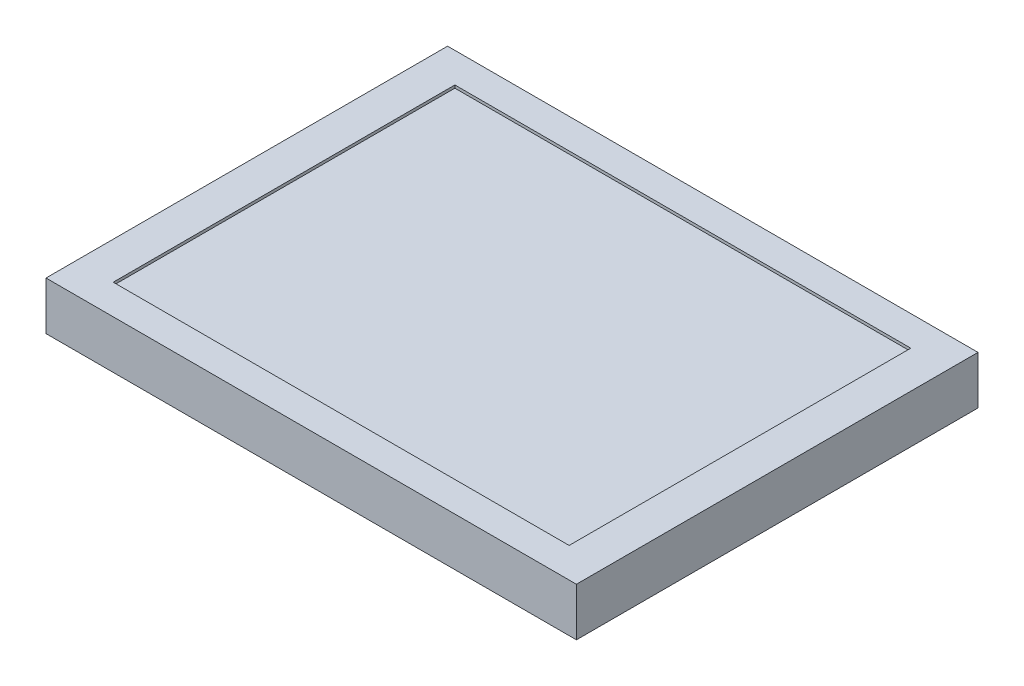
ISO-10303-21;
HEADER;
FILE_DESCRIPTION(('STEP AP214'),'2;1');
FILE_NAME('part.step','',(''),(''),'','','');
FILE_SCHEMA(('AUTOMOTIVE_DESIGN { 1 0 10303 214 1 1 1 1 }'));
ENDSEC;
DATA;
#1=APPLICATION_CONTEXT('core data for automotive mechanical design processes');
#2=APPLICATION_PROTOCOL_DEFINITION('international standard','automotive_design',2000,#1);
#3=PRODUCT_CONTEXT('',#1,'mechanical');
#4=PRODUCT('Part','Part','',(#3));
#5=PRODUCT_RELATED_PRODUCT_CATEGORY('part','',(#4));
#6=PRODUCT_DEFINITION_FORMATION('','',#4);
#7=PRODUCT_DEFINITION_CONTEXT('part definition',#1,'design');
#8=PRODUCT_DEFINITION('design','',#6,#7);
#9=PRODUCT_DEFINITION_SHAPE('','',#8);
#10=(LENGTH_UNIT() NAMED_UNIT(*) SI_UNIT(.MILLI.,.METRE.));
#11=(NAMED_UNIT(*) PLANE_ANGLE_UNIT() SI_UNIT($,.RADIAN.));
#12=(NAMED_UNIT(*) SI_UNIT($,.STERADIAN.) SOLID_ANGLE_UNIT());
#13=UNCERTAINTY_MEASURE_WITH_UNIT(LENGTH_MEASURE(1.E-05),#10,'distance_accuracy_value','');
#14=(GEOMETRIC_REPRESENTATION_CONTEXT(3) GLOBAL_UNCERTAINTY_ASSIGNED_CONTEXT((#13)) GLOBAL_UNIT_ASSIGNED_CONTEXT((#10,
#11,#12)) REPRESENTATION_CONTEXT('',''));
#15=CARTESIAN_POINT('',(0.,0.,0.));
#16=DIRECTION('',(0.,0.,1.));
#17=DIRECTION('',(1.,0.,0.));
#18=AXIS2_PLACEMENT_3D('',#15,#16,#17);
#19=CARTESIAN_POINT('',(0.,8.6,0.));
#20=DIRECTION('',(1.,0.,0.));
#21=DIRECTION('',(0.,0.,-1.));
#22=AXIS2_PLACEMENT_3D('',#19,#20,#21);
#23=PLANE('',#22);
#24=DIRECTION('',(0.,0.,1.));
#25=VECTOR('',#24,1.);
#26=CARTESIAN_POINT('',(0.,0.,0.));
#27=LINE('',#26,#25);
#28=CARTESIAN_POINT('',(0.,0.,-71.7));
#29=VERTEX_POINT('',#28);
#30=CARTESIAN_POINT('',(0.,0.,0.));
#31=VERTEX_POINT('',#30);
#32=EDGE_CURVE('E139',#29,#31,#27,.T.);
#33=ORIENTED_EDGE('',*,*,#32,.T.);
#34=DIRECTION('',(0.,-1.,0.));
#35=VECTOR('',#34,1.);
#36=CARTESIAN_POINT('',(0.,8.6,0.));
#37=LINE('',#36,#35);
#38=CARTESIAN_POINT('',(0.,8.6,0.));
#39=VERTEX_POINT('',#38);
#40=EDGE_CURVE('E11',#39,#31,#37,.T.);
#41=ORIENTED_EDGE('',*,*,#40,.F.);
#42=DIRECTION('',(0.,0.,1.));
#43=VECTOR('',#42,1.);
#44=CARTESIAN_POINT('',(0.,8.6,0.));
#45=LINE('',#44,#43);
#46=CARTESIAN_POINT('',(0.,8.6,-71.7));
#47=VERTEX_POINT('',#46);
#48=EDGE_CURVE('E143',#47,#39,#45,.T.);
#49=ORIENTED_EDGE('',*,*,#48,.F.);
#50=DIRECTION('',(0.,-1.,0.));
#51=VECTOR('',#50,1.);
#52=CARTESIAN_POINT('',(0.,8.6,-71.7));
#53=LINE('',#52,#51);
#54=EDGE_CURVE('E149',#47,#29,#53,.T.);
#55=ORIENTED_EDGE('',*,*,#54,.T.);
#56=EDGE_LOOP('',(#33,#41,#49,#55));
#57=FACE_BOUND('',#56,.T.);
#58=ADVANCED_FACE('F31',(#57),#23,.F.);
#59=CARTESIAN_POINT('',(0.,8.6,0.));
#60=DIRECTION('',(0.,0.,-1.));
#61=DIRECTION('',(-1.,0.,0.));
#62=AXIS2_PLACEMENT_3D('',#59,#60,#61);
#63=PLANE('',#62);
#64=DIRECTION('',(1.,0.,0.));
#65=VECTOR('',#64,1.);
#66=CARTESIAN_POINT('',(0.,0.,0.));
#67=LINE('',#66,#65);
#68=CARTESIAN_POINT('',(94.7,0.,0.));
#69=VERTEX_POINT('',#68);
#70=EDGE_CURVE('E152',#31,#69,#67,.T.);
#71=ORIENTED_EDGE('',*,*,#70,.T.);
#72=DIRECTION('',(0.,-1.,0.));
#73=VECTOR('',#72,1.);
#74=CARTESIAN_POINT('',(94.7,8.6,0.));
#75=LINE('',#74,#73);
#76=CARTESIAN_POINT('',(94.7,8.6,0.));
#77=VERTEX_POINT('',#76);
#78=EDGE_CURVE('E38',#77,#69,#75,.T.);
#79=ORIENTED_EDGE('',*,*,#78,.F.);
#80=DIRECTION('',(1.,0.,0.));
#81=VECTOR('',#80,1.);
#82=CARTESIAN_POINT('',(0.,8.6,0.));
#83=LINE('',#82,#81);
#84=EDGE_CURVE('E82',#39,#77,#83,.T.);
#85=ORIENTED_EDGE('',*,*,#84,.F.);
#86=ORIENTED_EDGE('',*,*,#40,.T.);
#87=EDGE_LOOP('',(#71,#79,#85,#86));
#88=FACE_BOUND('',#87,.T.);
#89=ADVANCED_FACE('F181',(#88),#63,.F.);
#90=CARTESIAN_POINT('',(94.7,8.6,0.));
#91=DIRECTION('',(-1.,0.,0.));
#92=DIRECTION('',(0.,0.,1.));
#93=AXIS2_PLACEMENT_3D('',#90,#91,#92);
#94=PLANE('',#93);
#95=DIRECTION('',(0.,0.,-1.));
#96=VECTOR('',#95,1.);
#97=CARTESIAN_POINT('',(94.7,0.,0.));
#98=LINE('',#97,#96);
#99=CARTESIAN_POINT('',(94.7,0.,-71.7));
#100=VERTEX_POINT('',#99);
#101=EDGE_CURVE('E154',#69,#100,#98,.T.);
#102=ORIENTED_EDGE('',*,*,#101,.T.);
#103=DIRECTION('',(0.,-1.,0.));
#104=VECTOR('',#103,1.);
#105=CARTESIAN_POINT('',(94.7,8.6,-71.7));
#106=LINE('',#105,#104);
#107=CARTESIAN_POINT('',(94.7,8.6,-71.7));
#108=VERTEX_POINT('',#107);
#109=EDGE_CURVE('E158',#108,#100,#106,.T.);
#110=ORIENTED_EDGE('',*,*,#109,.F.);
#111=DIRECTION('',(0.,0.,-1.));
#112=VECTOR('',#111,1.);
#113=CARTESIAN_POINT('',(94.7,8.6,0.));
#114=LINE('',#113,#112);
#115=EDGE_CURVE('E146',#77,#108,#114,.T.);
#116=ORIENTED_EDGE('',*,*,#115,.F.);
#117=ORIENTED_EDGE('',*,*,#78,.T.);
#118=EDGE_LOOP('',(#102,#110,#116,#117));
#119=FACE_BOUND('',#118,.T.);
#120=ADVANCED_FACE('F163',(#119),#94,.F.);
#121=CARTESIAN_POINT('',(0.,8.6,-71.7));
#122=DIRECTION('',(0.,0.,1.));
#123=DIRECTION('',(1.,0.,0.));
#124=AXIS2_PLACEMENT_3D('',#121,#122,#123);
#125=PLANE('',#124);
#126=DIRECTION('',(-1.,0.,0.));
#127=VECTOR('',#126,1.);
#128=CARTESIAN_POINT('',(0.,0.,-71.7));
#129=LINE('',#128,#127);
#130=EDGE_CURVE('E75',#100,#29,#129,.T.);
#131=ORIENTED_EDGE('',*,*,#130,.T.);
#132=ORIENTED_EDGE('',*,*,#54,.F.);
#133=DIRECTION('',(-1.,0.,0.));
#134=VECTOR('',#133,1.);
#135=CARTESIAN_POINT('',(0.,8.6,-71.7));
#136=LINE('',#135,#134);
#137=EDGE_CURVE('E54',#108,#47,#136,.T.);
#138=ORIENTED_EDGE('',*,*,#137,.F.);
#139=ORIENTED_EDGE('',*,*,#109,.T.);
#140=EDGE_LOOP('',(#131,#132,#138,#139));
#141=FACE_BOUND('',#140,.T.);
#142=ADVANCED_FACE('F171',(#141),#125,.F.);
#143=CARTESIAN_POINT('',(0.,8.6,-71.7));
#144=DIRECTION('',(0.,-1.,0.));
#145=DIRECTION('',(0.,0.,-1.));
#146=AXIS2_PLACEMENT_3D('',#143,#144,#145);
#147=PLANE('',#146);
#148=DIRECTION('',(1.,0.,0.));
#149=VECTOR('',#148,1.);
#150=CARTESIAN_POINT('',(6.65,8.6,-5.35));
#151=LINE('',#150,#149);
#152=CARTESIAN_POINT('',(6.65,8.6,-5.34999999999999));
#153=VERTEX_POINT('',#152);
#154=CARTESIAN_POINT('',(88.05,8.6,-5.35));
#155=VERTEX_POINT('',#154);
#156=EDGE_CURVE('E133',#153,#155,#151,.T.);
#157=ORIENTED_EDGE('',*,*,#156,.F.);
#158=DIRECTION('',(0.,0.,1.));
#159=VECTOR('',#158,1.);
#160=CARTESIAN_POINT('',(6.65,8.6,-5.35));
#161=LINE('',#160,#159);
#162=CARTESIAN_POINT('',(6.65,8.6,-66.35));
#163=VERTEX_POINT('',#162);
#164=EDGE_CURVE('E45',#163,#153,#161,.T.);
#165=ORIENTED_EDGE('',*,*,#164,.F.);
#166=DIRECTION('',(-1.,0.,0.));
#167=VECTOR('',#166,1.);
#168=CARTESIAN_POINT('',(6.65,8.6,-66.35));
#169=LINE('',#168,#167);
#170=CARTESIAN_POINT('',(88.05,8.6,-66.35));
#171=VERTEX_POINT('',#170);
#172=EDGE_CURVE('E124',#171,#163,#169,.T.);
#173=ORIENTED_EDGE('',*,*,#172,.F.);
#174=DIRECTION('',(0.,0.,-1.));
#175=VECTOR('',#174,1.);
#176=CARTESIAN_POINT('',(88.05,8.6,-5.35));
#177=LINE('',#176,#175);
#178=EDGE_CURVE('E127',#155,#171,#177,.T.);
#179=ORIENTED_EDGE('',*,*,#178,.F.);
#180=EDGE_LOOP('',(#157,#165,#173,#179));
#181=FACE_BOUND('',#180,.T.);
#182=ORIENTED_EDGE('',*,*,#48,.T.);
#183=ORIENTED_EDGE('',*,*,#84,.T.);
#184=ORIENTED_EDGE('',*,*,#115,.T.);
#185=ORIENTED_EDGE('',*,*,#137,.T.);
#186=EDGE_LOOP('',(#182,#183,#184,#185));
#187=FACE_BOUND('',#186,.T.);
#188=ADVANCED_FACE('F173',(#181,#187),#147,.F.);
#189=CARTESIAN_POINT('',(0.,0.,-71.7));
#190=DIRECTION('',(0.,-1.,0.));
#191=DIRECTION('',(0.,0.,-1.));
#192=AXIS2_PLACEMENT_3D('',#189,#190,#191);
#193=PLANE('',#192);
#194=ORIENTED_EDGE('',*,*,#32,.F.);
#195=ORIENTED_EDGE('',*,*,#130,.F.);
#196=ORIENTED_EDGE('',*,*,#101,.F.);
#197=ORIENTED_EDGE('',*,*,#70,.F.);
#198=EDGE_LOOP('',(#194,#195,#196,#197));
#199=FACE_BOUND('',#198,.T.);
#200=ADVANCED_FACE('F167',(#199),#193,.T.);
#201=CARTESIAN_POINT('',(6.65,8.1,-5.35));
#202=DIRECTION('',(-1.,0.,0.));
#203=DIRECTION('',(0.,0.,1.));
#204=AXIS2_PLACEMENT_3D('',#201,#202,#203);
#205=PLANE('',#204);
#206=ORIENTED_EDGE('',*,*,#164,.T.);
#207=DIRECTION('',(0.,1.,0.));
#208=VECTOR('',#207,1.);
#209=CARTESIAN_POINT('',(6.65,8.1,-5.35));
#210=LINE('',#209,#208);
#211=CARTESIAN_POINT('',(6.65,8.1,-5.35));
#212=VERTEX_POINT('',#211);
#213=EDGE_CURVE('E102',#212,#153,#210,.T.);
#214=ORIENTED_EDGE('',*,*,#213,.F.);
#215=DIRECTION('',(0.,0.,1.));
#216=VECTOR('',#215,1.);
#217=CARTESIAN_POINT('',(6.65,8.1,-5.35));
#218=LINE('',#217,#216);
#219=CARTESIAN_POINT('',(6.65,8.1,-66.35));
#220=VERTEX_POINT('',#219);
#221=EDGE_CURVE('E106',#220,#212,#218,.T.);
#222=ORIENTED_EDGE('',*,*,#221,.F.);
#223=DIRECTION('',(0.,1.,0.));
#224=VECTOR('',#223,1.);
#225=CARTESIAN_POINT('',(6.65,8.1,-66.35));
#226=LINE('',#225,#224);
#227=EDGE_CURVE('E137',#220,#163,#226,.T.);
#228=ORIENTED_EDGE('',*,*,#227,.T.);
#229=EDGE_LOOP('',(#206,#214,#222,#228));
#230=FACE_BOUND('',#229,.T.);
#231=ADVANCED_FACE('F104',(#230),#205,.F.);
#232=CARTESIAN_POINT('',(6.65,8.1,-66.35));
#233=DIRECTION('',(0.,0.,-1.));
#234=DIRECTION('',(-1.,0.,0.));
#235=AXIS2_PLACEMENT_3D('',#232,#233,#234);
#236=PLANE('',#235);
#237=ORIENTED_EDGE('',*,*,#172,.T.);
#238=ORIENTED_EDGE('',*,*,#227,.F.);
#239=DIRECTION('',(-1.,0.,0.));
#240=VECTOR('',#239,1.);
#241=CARTESIAN_POINT('',(6.65,8.1,-66.35));
#242=LINE('',#241,#240);
#243=CARTESIAN_POINT('',(88.05,8.1,-66.35));
#244=VERTEX_POINT('',#243);
#245=EDGE_CURVE('E112',#244,#220,#242,.T.);
#246=ORIENTED_EDGE('',*,*,#245,.F.);
#247=DIRECTION('',(0.,1.,0.));
#248=VECTOR('',#247,1.);
#249=CARTESIAN_POINT('',(88.05,8.1,-66.35));
#250=LINE('',#249,#248);
#251=EDGE_CURVE('E140',#244,#171,#250,.T.);
#252=ORIENTED_EDGE('',*,*,#251,.T.);
#253=EDGE_LOOP('',(#237,#238,#246,#252));
#254=FACE_BOUND('',#253,.T.);
#255=ADVANCED_FACE('F220',(#254),#236,.F.);
#256=CARTESIAN_POINT('',(88.05,8.1,-5.35));
#257=DIRECTION('',(1.,0.,0.));
#258=DIRECTION('',(0.,0.,-1.));
#259=AXIS2_PLACEMENT_3D('',#256,#257,#258);
#260=PLANE('',#259);
#261=ORIENTED_EDGE('',*,*,#178,.T.);
#262=ORIENTED_EDGE('',*,*,#251,.F.);
#263=DIRECTION('',(0.,0.,-1.));
#264=VECTOR('',#263,1.);
#265=CARTESIAN_POINT('',(88.05,8.1,-5.35));
#266=LINE('',#265,#264);
#267=CARTESIAN_POINT('',(88.05,8.1,-5.35));
#268=VERTEX_POINT('',#267);
#269=EDGE_CURVE('E120',#268,#244,#266,.T.);
#270=ORIENTED_EDGE('',*,*,#269,.F.);
#271=DIRECTION('',(0.,1.,0.));
#272=VECTOR('',#271,1.);
#273=CARTESIAN_POINT('',(88.05,8.1,-5.35));
#274=LINE('',#273,#272);
#275=EDGE_CURVE('E111',#268,#155,#274,.T.);
#276=ORIENTED_EDGE('',*,*,#275,.T.);
#277=EDGE_LOOP('',(#261,#262,#270,#276));
#278=FACE_BOUND('',#277,.T.);
#279=ADVANCED_FACE('F229',(#278),#260,.F.);
#280=CARTESIAN_POINT('',(6.65,8.1,-5.35));
#281=DIRECTION('',(0.,0.,1.));
#282=DIRECTION('',(1.,0.,0.));
#283=AXIS2_PLACEMENT_3D('',#280,#281,#282);
#284=PLANE('',#283);
#285=ORIENTED_EDGE('',*,*,#156,.T.);
#286=ORIENTED_EDGE('',*,*,#275,.F.);
#287=DIRECTION('',(1.,0.,0.));
#288=VECTOR('',#287,1.);
#289=CARTESIAN_POINT('',(6.65,8.1,-5.35));
#290=LINE('',#289,#288);
#291=EDGE_CURVE('E115',#212,#268,#290,.T.);
#292=ORIENTED_EDGE('',*,*,#291,.F.);
#293=ORIENTED_EDGE('',*,*,#213,.T.);
#294=EDGE_LOOP('',(#285,#286,#292,#293));
#295=FACE_BOUND('',#294,.T.);
#296=ADVANCED_FACE('F116',(#295),#284,.F.);
#297=CARTESIAN_POINT('',(6.65,8.1,-66.35));
#298=DIRECTION('',(0.,-1.,0.));
#299=DIRECTION('',(0.,0.,-1.));
#300=AXIS2_PLACEMENT_3D('',#297,#298,#299);
#301=PLANE('',#300);
#302=ORIENTED_EDGE('',*,*,#221,.T.);
#303=ORIENTED_EDGE('',*,*,#291,.T.);
#304=ORIENTED_EDGE('',*,*,#269,.T.);
#305=ORIENTED_EDGE('',*,*,#245,.T.);
#306=EDGE_LOOP('',(#302,#303,#304,#305));
#307=FACE_BOUND('',#306,.T.);
#308=ADVANCED_FACE('F122',(#307),#301,.F.);
#309=CLOSED_SHELL('',(#58,#89,#120,#142,#188,#200,#231,#255,#279,#296,#308));
#310=MANIFOLD_SOLID_BREP('B2',#309);
#311=ADVANCED_BREP_SHAPE_REPRESENTATION('',(#18,#310),#14);
#312=SHAPE_DEFINITION_REPRESENTATION(#9,#311);
ENDSEC;
END-ISO-10303-21;
